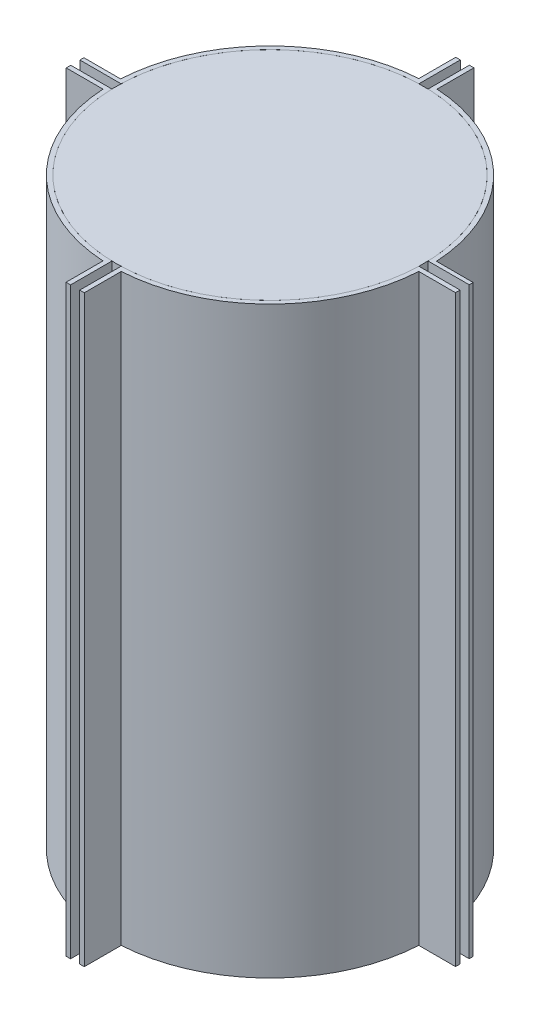
ISO-10303-21;
HEADER;
FILE_DESCRIPTION(('STEP AP214'),'2;1');
FILE_NAME('part.step','',(''),(''),'','','');
FILE_SCHEMA(('AUTOMOTIVE_DESIGN { 1 0 10303 214 1 1 1 1 }'));
ENDSEC;
DATA;
#1=APPLICATION_CONTEXT('core data for automotive mechanical design processes');
#2=APPLICATION_PROTOCOL_DEFINITION('international standard','automotive_design',2000,#1);
#3=PRODUCT_CONTEXT('',#1,'mechanical');
#4=PRODUCT('Part','Part','',(#3));
#5=PRODUCT_RELATED_PRODUCT_CATEGORY('part','',(#4));
#6=PRODUCT_DEFINITION_FORMATION('','',#4);
#7=PRODUCT_DEFINITION_CONTEXT('part definition',#1,'design');
#8=PRODUCT_DEFINITION('design','',#6,#7);
#9=PRODUCT_DEFINITION_SHAPE('','',#8);
#10=(LENGTH_UNIT() NAMED_UNIT(*) SI_UNIT(.MILLI.,.METRE.));
#11=(NAMED_UNIT(*) PLANE_ANGLE_UNIT() SI_UNIT($,.RADIAN.));
#12=(NAMED_UNIT(*) SI_UNIT($,.STERADIAN.) SOLID_ANGLE_UNIT());
#13=UNCERTAINTY_MEASURE_WITH_UNIT(LENGTH_MEASURE(1.E-05),#10,'distance_accuracy_value','');
#14=(GEOMETRIC_REPRESENTATION_CONTEXT(3) GLOBAL_UNCERTAINTY_ASSIGNED_CONTEXT((#13)) GLOBAL_UNIT_ASSIGNED_CONTEXT((#10,
#11,#12)) REPRESENTATION_CONTEXT('',''));
#15=CARTESIAN_POINT('',(0.,0.,0.));
#16=DIRECTION('',(0.,0.,1.));
#17=DIRECTION('',(1.,0.,0.));
#18=AXIS2_PLACEMENT_3D('',#15,#16,#17);
#19=CARTESIAN_POINT('',(0.,406.4,0.));
#20=DIRECTION('',(0.,-1.,0.));
#21=DIRECTION('',(0.,0.,-1.));
#22=AXIS2_PLACEMENT_3D('',#19,#20,#21);
#23=CYLINDRICAL_SURFACE('',#22,110.109);
#24=DIRECTION('',(0.,-1.,0.));
#25=VECTOR('',#24,1.);
#26=CARTESIAN_POINT('',(-6.34951847454214,406.4,-109.925772665656));
#27=LINE('',#26,#25);
#28=CARTESIAN_POINT('',(-6.34951847454214,0.,-109.925772665656));
#29=VERTEX_POINT('',#28);
#30=CARTESIAN_POINT('',(-6.34951847454214,406.4,-109.925772665656));
#31=VERTEX_POINT('',#30);
#32=EDGE_CURVE('E92',#29,#31,#27,.F.);
#33=ORIENTED_EDGE('',*,*,#32,.F.);
#34=CARTESIAN_POINT('',(0.,0.,0.));
#35=DIRECTION('',(0.,1.,0.));
#36=DIRECTION('',(0.,0.,1.));
#37=AXIS2_PLACEMENT_3D('',#34,#35,#36);
#38=CIRCLE('',#37,110.109);
#39=CARTESIAN_POINT('',(-109.948438829366,0.,-5.94412987619484));
#40=VERTEX_POINT('',#39);
#41=EDGE_CURVE('E198',#29,#40,#38,.T.);
#42=ORIENTED_EDGE('',*,*,#41,.T.);
#43=DIRECTION('',(0.,-1.,0.));
#44=VECTOR('',#43,1.);
#45=CARTESIAN_POINT('',(-109.948438829366,406.4,-5.94412987619484));
#46=LINE('',#45,#44);
#47=CARTESIAN_POINT('',(-109.948438829366,406.4,-5.94412987619484));
#48=VERTEX_POINT('',#47);
#49=EDGE_CURVE('E13',#48,#40,#46,.T.);
#50=ORIENTED_EDGE('',*,*,#49,.F.);
#51=CARTESIAN_POINT('',(0.,406.4,0.));
#52=DIRECTION('',(0.,1.,0.));
#53=DIRECTION('',(0.,0.,1.));
#54=AXIS2_PLACEMENT_3D('',#51,#52,#53);
#55=CIRCLE('',#54,110.109);
#56=EDGE_CURVE('E88',#31,#48,#55,.T.);
#57=ORIENTED_EDGE('',*,*,#56,.F.);
#58=EDGE_LOOP('',(#33,#42,#50,#57));
#59=FACE_BOUND('',#58,.T.);
#60=ADVANCED_FACE('F73',(#59),#23,.T.);
#61=CARTESIAN_POINT('',(0.,406.4,0.));
#62=DIRECTION('',(0.,1.,0.));
#63=DIRECTION('',(0.,0.,1.));
#64=AXIS2_PLACEMENT_3D('',#61,#62,#63);
#65=PLANE('',#64);
#66=DIRECTION('',(0.,0.,-1.));
#67=VECTOR('',#66,1.);
#68=CARTESIAN_POINT('',(-3.175,406.4,127.));
#69=LINE('',#68,#67);
#70=CARTESIAN_POINT('',(-3.175,406.4,-106.886854809186));
#71=VERTEX_POINT('',#70);
#72=CARTESIAN_POINT('',(-3.175,406.4,-135.646128135072));
#73=VERTEX_POINT('',#72);
#74=EDGE_CURVE('E135',#71,#73,#69,.T.);
#75=ORIENTED_EDGE('',*,*,#74,.T.);
#76=DIRECTION('',(-1.,0.,0.));
#77=VECTOR('',#76,1.);
#78=CARTESIAN_POINT('',(-3.175,406.4,-135.646128135072));
#79=LINE('',#78,#77);
#80=CARTESIAN_POINT('',(-6.34951847454214,406.4,-135.646128135072));
#81=VERTEX_POINT('',#80);
#82=EDGE_CURVE('E139',#73,#81,#79,.T.);
#83=ORIENTED_EDGE('',*,*,#82,.T.);
#84=DIRECTION('',(0.,0.,1.));
#85=VECTOR('',#84,1.);
#86=CARTESIAN_POINT('',(-6.34951847454214,406.4,-135.646128135072));
#87=LINE('',#86,#85);
#88=EDGE_CURVE('E160',#81,#31,#87,.T.);
#89=ORIENTED_EDGE('',*,*,#88,.T.);
#90=ORIENTED_EDGE('',*,*,#56,.T.);
#91=DIRECTION('',(-1.,0.,0.));
#92=VECTOR('',#91,1.);
#93=CARTESIAN_POINT('',(-135.520832555867,406.4,-5.94412987619484));
#94=LINE('',#93,#92);
#95=CARTESIAN_POINT('',(-135.520832555867,406.4,-5.94412987619484));
#96=VERTEX_POINT('',#95);
#97=EDGE_CURVE('E172',#48,#96,#94,.T.);
#98=ORIENTED_EDGE('',*,*,#97,.T.);
#99=DIRECTION('',(0.,0.,1.));
#100=VECTOR('',#99,1.);
#101=CARTESIAN_POINT('',(-135.520832555867,406.4,-3.175));
#102=LINE('',#101,#100);
#103=CARTESIAN_POINT('',(-135.520832555867,406.4,-3.175));
#104=VERTEX_POINT('',#103);
#105=EDGE_CURVE('E174',#96,#104,#102,.T.);
#106=ORIENTED_EDGE('',*,*,#105,.T.);
#107=DIRECTION('',(1.,0.,0.));
#108=VECTOR('',#107,1.);
#109=CARTESIAN_POINT('',(-127.,406.4,-3.175));
#110=LINE('',#109,#108);
#111=CARTESIAN_POINT('',(-106.886854809186,406.4,-3.175));
#112=VERTEX_POINT('',#111);
#113=EDGE_CURVE('E146',#104,#112,#110,.T.);
#114=ORIENTED_EDGE('',*,*,#113,.T.);
#115=CARTESIAN_POINT('',(0.,406.4,0.));
#116=DIRECTION('',(0.,1.,0.));
#117=DIRECTION('',(0.,0.,-1.));
#118=AXIS2_PLACEMENT_3D('',#115,#116,#117);
#119=CIRCLE('',#118,106.934);
#120=EDGE_CURVE('E143',#71,#112,#119,.T.);
#121=ORIENTED_EDGE('',*,*,#120,.F.);
#122=EDGE_LOOP('',(#75,#83,#89,#90,#98,#106,#114,#121));
#123=FACE_BOUND('',#122,.T.);
#124=ADVANCED_FACE('F75',(#123),#65,.T.);
#125=CARTESIAN_POINT('',(0.,0.,0.));
#126=DIRECTION('',(0.,1.,0.));
#127=DIRECTION('',(0.,0.,1.));
#128=AXIS2_PLACEMENT_3D('',#125,#126,#127);
#129=PLANE('',#128);
#130=ORIENTED_EDGE('',*,*,#41,.F.);
#131=DIRECTION('',(0.,0.,1.));
#132=VECTOR('',#131,1.);
#133=CARTESIAN_POINT('',(-6.34951847454214,0.,-135.646128135072));
#134=LINE('',#133,#132);
#135=CARTESIAN_POINT('',(-6.34951847454214,0.,-135.646128135072));
#136=VERTEX_POINT('',#135);
#137=EDGE_CURVE('E161',#136,#29,#134,.T.);
#138=ORIENTED_EDGE('',*,*,#137,.F.);
#139=DIRECTION('',(-1.,0.,0.));
#140=VECTOR('',#139,1.);
#141=CARTESIAN_POINT('',(-3.175,0.,-135.646128135072));
#142=LINE('',#141,#140);
#143=CARTESIAN_POINT('',(-3.175,0.,-135.646128135072));
#144=VERTEX_POINT('',#143);
#145=EDGE_CURVE('E165',#144,#136,#142,.T.);
#146=ORIENTED_EDGE('',*,*,#145,.F.);
#147=DIRECTION('',(0.,0.,-1.));
#148=VECTOR('',#147,1.);
#149=CARTESIAN_POINT('',(-3.175,0.,127.));
#150=LINE('',#149,#148);
#151=CARTESIAN_POINT('',(-3.175,0.,-106.886854809186));
#152=VERTEX_POINT('',#151);
#153=EDGE_CURVE('E152',#152,#144,#150,.T.);
#154=ORIENTED_EDGE('',*,*,#153,.F.);
#155=CARTESIAN_POINT('',(0.,0.,0.));
#156=DIRECTION('',(0.,1.,0.));
#157=DIRECTION('',(0.,0.,-1.));
#158=AXIS2_PLACEMENT_3D('',#155,#156,#157);
#159=CIRCLE('',#158,106.934);
#160=CARTESIAN_POINT('',(-106.886854809186,0.,-3.175));
#161=VERTEX_POINT('',#160);
#162=EDGE_CURVE('E195',#152,#161,#159,.T.);
#163=ORIENTED_EDGE('',*,*,#162,.T.);
#164=DIRECTION('',(1.,0.,0.));
#165=VECTOR('',#164,1.);
#166=CARTESIAN_POINT('',(-127.,0.,-3.175));
#167=LINE('',#166,#165);
#168=CARTESIAN_POINT('',(-135.520832555867,0.,-3.175));
#169=VERTEX_POINT('',#168);
#170=EDGE_CURVE('E188',#169,#161,#167,.T.);
#171=ORIENTED_EDGE('',*,*,#170,.F.);
#172=DIRECTION('',(0.,0.,1.));
#173=VECTOR('',#172,1.);
#174=CARTESIAN_POINT('',(-135.520832555867,0.,-3.175));
#175=LINE('',#174,#173);
#176=CARTESIAN_POINT('',(-135.520832555867,0.,-5.94412987619484));
#177=VERTEX_POINT('',#176);
#178=EDGE_CURVE('E175',#177,#169,#175,.T.);
#179=ORIENTED_EDGE('',*,*,#178,.F.);
#180=DIRECTION('',(-1.,0.,0.));
#181=VECTOR('',#180,1.);
#182=CARTESIAN_POINT('',(-135.520832555867,0.,-5.94412987619484));
#183=LINE('',#182,#181);
#184=EDGE_CURVE('E171',#40,#177,#183,.T.);
#185=ORIENTED_EDGE('',*,*,#184,.F.);
#186=EDGE_LOOP('',(#130,#138,#146,#154,#163,#171,#179,#185));
#187=FACE_BOUND('',#186,.T.);
#188=ADVANCED_FACE('F204',(#187),#129,.F.);
#189=CARTESIAN_POINT('',(0.,406.4,0.));
#190=DIRECTION('',(0.,-1.,0.));
#191=DIRECTION('',(0.,0.,-1.));
#192=AXIS2_PLACEMENT_3D('',#189,#190,#191);
#193=CYLINDRICAL_SURFACE('',#192,106.934);
#194=DIRECTION('',(0.,-1.,0.));
#195=VECTOR('',#194,1.);
#196=CARTESIAN_POINT('',(-106.886854809186,406.4,-3.175));
#197=LINE('',#196,#195);
#198=EDGE_CURVE('E81',#161,#112,#197,.F.);
#199=ORIENTED_EDGE('',*,*,#198,.F.);
#200=ORIENTED_EDGE('',*,*,#162,.F.);
#201=DIRECTION('',(0.,-1.,0.));
#202=VECTOR('',#201,1.);
#203=CARTESIAN_POINT('',(-3.175,406.4,-106.886854809186));
#204=LINE('',#203,#202);
#205=EDGE_CURVE('E189',#71,#152,#204,.T.);
#206=ORIENTED_EDGE('',*,*,#205,.F.);
#207=ORIENTED_EDGE('',*,*,#120,.T.);
#208=EDGE_LOOP('',(#199,#200,#206,#207));
#209=FACE_BOUND('',#208,.T.);
#210=ADVANCED_FACE('F201',(#209),#193,.F.);
#211=CARTESIAN_POINT('',(-3.175,406.4,127.));
#212=DIRECTION('',(-1.,0.,0.));
#213=DIRECTION('',(0.,0.,1.));
#214=AXIS2_PLACEMENT_3D('',#211,#212,#213);
#215=PLANE('',#214);
#216=ORIENTED_EDGE('',*,*,#74,.F.);
#217=ORIENTED_EDGE('',*,*,#205,.T.);
#218=ORIENTED_EDGE('',*,*,#153,.T.);
#219=DIRECTION('',(0.,-1.,0.));
#220=VECTOR('',#219,1.);
#221=CARTESIAN_POINT('',(-3.175,406.4,-135.646128135072));
#222=LINE('',#221,#220);
#223=EDGE_CURVE('E149',#73,#144,#222,.T.);
#224=ORIENTED_EDGE('',*,*,#223,.F.);
#225=EDGE_LOOP('',(#216,#217,#218,#224));
#226=FACE_BOUND('',#225,.T.);
#227=ADVANCED_FACE('F150',(#226),#215,.F.);
#228=CARTESIAN_POINT('',(-127.,406.4,-3.175));
#229=DIRECTION('',(0.,0.,-1.));
#230=DIRECTION('',(-1.,0.,0.));
#231=AXIS2_PLACEMENT_3D('',#228,#229,#230);
#232=PLANE('',#231);
#233=ORIENTED_EDGE('',*,*,#170,.T.);
#234=ORIENTED_EDGE('',*,*,#198,.T.);
#235=ORIENTED_EDGE('',*,*,#113,.F.);
#236=DIRECTION('',(0.,-1.,0.));
#237=VECTOR('',#236,1.);
#238=CARTESIAN_POINT('',(-135.520832555867,406.4,-3.175));
#239=LINE('',#238,#237);
#240=EDGE_CURVE('E178',#104,#169,#239,.T.);
#241=ORIENTED_EDGE('',*,*,#240,.T.);
#242=EDGE_LOOP('',(#233,#234,#235,#241));
#243=FACE_BOUND('',#242,.T.);
#244=ADVANCED_FACE('F219',(#243),#232,.F.);
#245=CARTESIAN_POINT('',(-135.520832555867,406.4,-5.94412987619484));
#246=DIRECTION('',(0.,0.,1.));
#247=DIRECTION('',(1.,0.,0.));
#248=AXIS2_PLACEMENT_3D('',#245,#246,#247);
#249=PLANE('',#248);
#250=ORIENTED_EDGE('',*,*,#97,.F.);
#251=ORIENTED_EDGE('',*,*,#49,.T.);
#252=ORIENTED_EDGE('',*,*,#184,.T.);
#253=DIRECTION('',(0.,-1.,0.));
#254=VECTOR('',#253,1.);
#255=CARTESIAN_POINT('',(-135.520832555867,406.4,-5.94412987619484));
#256=LINE('',#255,#254);
#257=EDGE_CURVE('E184',#96,#177,#256,.T.);
#258=ORIENTED_EDGE('',*,*,#257,.F.);
#259=EDGE_LOOP('',(#250,#251,#252,#258));
#260=FACE_BOUND('',#259,.T.);
#261=ADVANCED_FACE('F212',(#260),#249,.F.);
#262=CARTESIAN_POINT('',(-135.520832555867,406.4,-3.175));
#263=DIRECTION('',(1.,0.,0.));
#264=DIRECTION('',(0.,0.,-1.));
#265=AXIS2_PLACEMENT_3D('',#262,#263,#264);
#266=PLANE('',#265);
#267=ORIENTED_EDGE('',*,*,#178,.T.);
#268=ORIENTED_EDGE('',*,*,#240,.F.);
#269=ORIENTED_EDGE('',*,*,#105,.F.);
#270=ORIENTED_EDGE('',*,*,#257,.T.);
#271=EDGE_LOOP('',(#267,#268,#269,#270));
#272=FACE_BOUND('',#271,.T.);
#273=ADVANCED_FACE('F217',(#272),#266,.F.);
#274=CARTESIAN_POINT('',(-6.34951847454214,406.4,-135.646128135072));
#275=DIRECTION('',(1.,0.,0.));
#276=DIRECTION('',(0.,0.,-1.));
#277=AXIS2_PLACEMENT_3D('',#274,#275,#276);
#278=PLANE('',#277);
#279=ORIENTED_EDGE('',*,*,#137,.T.);
#280=ORIENTED_EDGE('',*,*,#32,.T.);
#281=ORIENTED_EDGE('',*,*,#88,.F.);
#282=DIRECTION('',(0.,-1.,0.));
#283=VECTOR('',#282,1.);
#284=CARTESIAN_POINT('',(-6.34951847454214,406.4,-135.646128135072));
#285=LINE('',#284,#283);
#286=EDGE_CURVE('E155',#81,#136,#285,.T.);
#287=ORIENTED_EDGE('',*,*,#286,.T.);
#288=EDGE_LOOP('',(#279,#280,#281,#287));
#289=FACE_BOUND('',#288,.T.);
#290=ADVANCED_FACE('F207',(#289),#278,.F.);
#291=CARTESIAN_POINT('',(-3.175,406.4,-135.646128135072));
#292=DIRECTION('',(0.,0.,1.));
#293=DIRECTION('',(1.,0.,0.));
#294=AXIS2_PLACEMENT_3D('',#291,#292,#293);
#295=PLANE('',#294);
#296=ORIENTED_EDGE('',*,*,#145,.T.);
#297=ORIENTED_EDGE('',*,*,#286,.F.);
#298=ORIENTED_EDGE('',*,*,#82,.F.);
#299=ORIENTED_EDGE('',*,*,#223,.T.);
#300=EDGE_LOOP('',(#296,#297,#298,#299));
#301=FACE_BOUND('',#300,.T.);
#302=ADVANCED_FACE('F157',(#301),#295,.F.);
#303=CLOSED_SHELL('',(#60,#124,#188,#210,#227,#244,#261,#273,#290,#302));
#304=MANIFOLD_SOLID_BREP('B2',#303);
#305=CARTESIAN_POINT('',(0.,406.4,0.));
#306=DIRECTION('',(0.,-1.,0.));
#307=DIRECTION('',(0.,0.,-1.));
#308=AXIS2_PLACEMENT_3D('',#305,#306,#307);
#309=CYLINDRICAL_SURFACE('',#308,110.109);
#310=DIRECTION('',(0.,-1.,0.));
#311=VECTOR('',#310,1.);
#312=CARTESIAN_POINT('',(6.34951847454214,406.4,109.925772665656));
#313=LINE('',#312,#311);
#314=CARTESIAN_POINT('',(6.34951847454214,0.,109.925772665656));
#315=VERTEX_POINT('',#314);
#316=CARTESIAN_POINT('',(6.34951847454214,406.4,109.925772665656));
#317=VERTEX_POINT('',#316);
#318=EDGE_CURVE('E431',#315,#317,#313,.F.);
#319=ORIENTED_EDGE('',*,*,#318,.F.);
#320=CARTESIAN_POINT('',(0.,0.,0.));
#321=DIRECTION('',(0.,1.,0.));
#322=DIRECTION('',(0.,0.,1.));
#323=AXIS2_PLACEMENT_3D('',#320,#321,#322);
#324=CIRCLE('',#323,110.109);
#325=CARTESIAN_POINT('',(109.925744850786,0.,6.35));
#326=VERTEX_POINT('',#325);
#327=EDGE_CURVE('E458',#315,#326,#324,.T.);
#328=ORIENTED_EDGE('',*,*,#327,.T.);
#329=DIRECTION('',(0.,-1.,0.));
#330=VECTOR('',#329,1.);
#331=CARTESIAN_POINT('',(109.925744850786,406.4,6.35));
#332=LINE('',#331,#330);
#333=CARTESIAN_POINT('',(109.925744850786,406.4,6.35));
#334=VERTEX_POINT('',#333);
#335=EDGE_CURVE('E453',#334,#326,#332,.T.);
#336=ORIENTED_EDGE('',*,*,#335,.F.);
#337=CARTESIAN_POINT('',(0.,406.4,0.));
#338=DIRECTION('',(0.,1.,0.));
#339=DIRECTION('',(0.,0.,1.));
#340=AXIS2_PLACEMENT_3D('',#337,#338,#339);
#341=CIRCLE('',#340,110.109);
#342=EDGE_CURVE('E415',#317,#334,#341,.T.);
#343=ORIENTED_EDGE('',*,*,#342,.F.);
#344=EDGE_LOOP('',(#319,#328,#336,#343));
#345=FACE_BOUND('',#344,.T.);
#346=ADVANCED_FACE('F346',(#345),#309,.T.);
#347=CARTESIAN_POINT('',(0.,406.4,0.));
#348=DIRECTION('',(0.,-1.,0.));
#349=DIRECTION('',(0.,0.,-1.));
#350=AXIS2_PLACEMENT_3D('',#347,#348,#349);
#351=CYLINDRICAL_SURFACE('',#350,106.934);
#352=CARTESIAN_POINT('',(0.,406.4,0.));
#353=DIRECTION('',(0.,1.,0.));
#354=DIRECTION('',(0.,0.,-1.));
#355=AXIS2_PLACEMENT_3D('',#352,#353,#354);
#356=CIRCLE('',#355,106.934);
#357=CARTESIAN_POINT('',(3.175,406.4,106.886854809186));
#358=VERTEX_POINT('',#357);
#359=CARTESIAN_POINT('',(106.886854809186,406.4,3.17499999999997));
#360=VERTEX_POINT('',#359);
#361=EDGE_CURVE('E350',#358,#360,#356,.T.);
#362=ORIENTED_EDGE('',*,*,#361,.T.);
#363=DIRECTION('',(0.,-1.,0.));
#364=VECTOR('',#363,1.);
#365=CARTESIAN_POINT('',(106.886854809186,406.4,3.17499999999997));
#366=LINE('',#365,#364);
#367=CARTESIAN_POINT('',(106.886854809186,0.,3.17499999999997));
#368=VERTEX_POINT('',#367);
#369=EDGE_CURVE('E363',#360,#368,#366,.T.);
#370=ORIENTED_EDGE('',*,*,#369,.T.);
#371=CARTESIAN_POINT('',(0.,0.,0.));
#372=DIRECTION('',(0.,1.,0.));
#373=DIRECTION('',(0.,0.,-1.));
#374=AXIS2_PLACEMENT_3D('',#371,#372,#373);
#375=CIRCLE('',#374,106.934);
#376=CARTESIAN_POINT('',(3.175,0.,106.886854809186));
#377=VERTEX_POINT('',#376);
#378=EDGE_CURVE('E460',#377,#368,#375,.T.);
#379=ORIENTED_EDGE('',*,*,#378,.F.);
#380=DIRECTION('',(0.,-1.,0.));
#381=VECTOR('',#380,1.);
#382=CARTESIAN_POINT('',(3.175,406.4,106.886854809186));
#383=LINE('',#382,#381);
#384=EDGE_CURVE('E457',#377,#358,#383,.F.);
#385=ORIENTED_EDGE('',*,*,#384,.T.);
#386=EDGE_LOOP('',(#362,#370,#379,#385));
#387=FACE_BOUND('',#386,.T.);
#388=ADVANCED_FACE('F472',(#387),#351,.F.);
#389=CARTESIAN_POINT('',(0.,0.,0.));
#390=DIRECTION('',(0.,1.,0.));
#391=DIRECTION('',(0.,0.,1.));
#392=AXIS2_PLACEMENT_3D('',#389,#390,#391);
#393=PLANE('',#392);
#394=ORIENTED_EDGE('',*,*,#327,.F.);
#395=DIRECTION('',(0.,0.,-1.));
#396=VECTOR('',#395,1.);
#397=CARTESIAN_POINT('',(6.34951847454214,0.,135.646128135072));
#398=LINE('',#397,#396);
#399=CARTESIAN_POINT('',(6.34951847454214,0.,135.646128135072));
#400=VERTEX_POINT('',#399);
#401=EDGE_CURVE('E425',#400,#315,#398,.T.);
#402=ORIENTED_EDGE('',*,*,#401,.F.);
#403=DIRECTION('',(1.,0.,0.));
#404=VECTOR('',#403,1.);
#405=CARTESIAN_POINT('',(3.175,0.,135.646128135072));
#406=LINE('',#405,#404);
#407=CARTESIAN_POINT('',(3.175,0.,135.646128135072));
#408=VERTEX_POINT('',#407);
#409=EDGE_CURVE('E504',#408,#400,#406,.T.);
#410=ORIENTED_EDGE('',*,*,#409,.F.);
#411=DIRECTION('',(0.,0.,-1.));
#412=VECTOR('',#411,1.);
#413=CARTESIAN_POINT('',(3.175,0.,127.));
#414=LINE('',#413,#412);
#415=EDGE_CURVE('E429',#408,#377,#414,.T.);
#416=ORIENTED_EDGE('',*,*,#415,.T.);
#417=ORIENTED_EDGE('',*,*,#378,.T.);
#418=DIRECTION('',(1.,0.,0.));
#419=VECTOR('',#418,1.);
#420=CARTESIAN_POINT('',(-127.,0.,3.175));
#421=LINE('',#420,#419);
#422=CARTESIAN_POINT('',(135.520832641872,0.,3.17499999999997));
#423=VERTEX_POINT('',#422);
#424=EDGE_CURVE('E461',#368,#423,#421,.T.);
#425=ORIENTED_EDGE('',*,*,#424,.T.);
#426=DIRECTION('',(0.,0.,-1.));
#427=VECTOR('',#426,1.);
#428=CARTESIAN_POINT('',(135.520832641872,0.,3.17499999999997));
#429=LINE('',#428,#427);
#430=CARTESIAN_POINT('',(135.520832641872,0.,6.34999999999997));
#431=VERTEX_POINT('',#430);
#432=EDGE_CURVE('E433',#431,#423,#429,.T.);
#433=ORIENTED_EDGE('',*,*,#432,.F.);
#434=DIRECTION('',(1.,0.,0.));
#435=VECTOR('',#434,1.);
#436=CARTESIAN_POINT('',(135.520832641872,0.,6.34999999999997));
#437=LINE('',#436,#435);
#438=EDGE_CURVE('E442',#326,#431,#437,.T.);
#439=ORIENTED_EDGE('',*,*,#438,.F.);
#440=EDGE_LOOP('',(#394,#402,#410,#416,#417,#425,#433,#439));
#441=FACE_BOUND('',#440,.T.);
#442=ADVANCED_FACE('F469',(#441),#393,.F.);
#443=CARTESIAN_POINT('',(0.,406.4,0.));
#444=DIRECTION('',(0.,1.,0.));
#445=DIRECTION('',(0.,0.,1.));
#446=AXIS2_PLACEMENT_3D('',#443,#444,#445);
#447=PLANE('',#446);
#448=DIRECTION('',(0.,0.,-1.));
#449=VECTOR('',#448,1.);
#450=CARTESIAN_POINT('',(3.175,406.4,127.));
#451=LINE('',#450,#449);
#452=CARTESIAN_POINT('',(3.175,406.4,135.646128135072));
#453=VERTEX_POINT('',#452);
#454=EDGE_CURVE('E356',#453,#358,#451,.T.);
#455=ORIENTED_EDGE('',*,*,#454,.F.);
#456=DIRECTION('',(1.,0.,0.));
#457=VECTOR('',#456,1.);
#458=CARTESIAN_POINT('',(3.175,406.4,135.646128135072));
#459=LINE('',#458,#457);
#460=CARTESIAN_POINT('',(6.34951847454214,406.4,135.646128135072));
#461=VERTEX_POINT('',#460);
#462=EDGE_CURVE('E408',#453,#461,#459,.T.);
#463=ORIENTED_EDGE('',*,*,#462,.T.);
#464=DIRECTION('',(0.,0.,-1.));
#465=VECTOR('',#464,1.);
#466=CARTESIAN_POINT('',(6.34951847454214,406.4,135.646128135072));
#467=LINE('',#466,#465);
#468=EDGE_CURVE('E424',#461,#317,#467,.T.);
#469=ORIENTED_EDGE('',*,*,#468,.T.);
#470=ORIENTED_EDGE('',*,*,#342,.T.);
#471=DIRECTION('',(1.,0.,0.));
#472=VECTOR('',#471,1.);
#473=CARTESIAN_POINT('',(135.520832641872,406.4,6.34999999999997));
#474=LINE('',#473,#472);
#475=CARTESIAN_POINT('',(135.520832641872,406.4,6.34999999999997));
#476=VERTEX_POINT('',#475);
#477=EDGE_CURVE('E441',#334,#476,#474,.T.);
#478=ORIENTED_EDGE('',*,*,#477,.T.);
#479=DIRECTION('',(0.,0.,-1.));
#480=VECTOR('',#479,1.);
#481=CARTESIAN_POINT('',(135.520832641872,406.4,3.17499999999997));
#482=LINE('',#481,#480);
#483=CARTESIAN_POINT('',(135.520832641872,406.4,3.17499999999997));
#484=VERTEX_POINT('',#483);
#485=EDGE_CURVE('E438',#476,#484,#482,.T.);
#486=ORIENTED_EDGE('',*,*,#485,.T.);
#487=DIRECTION('',(1.,0.,0.));
#488=VECTOR('',#487,1.);
#489=CARTESIAN_POINT('',(-127.,406.4,3.175));
#490=LINE('',#489,#488);
#491=EDGE_CURVE('E71',#360,#484,#490,.T.);
#492=ORIENTED_EDGE('',*,*,#491,.F.);
#493=ORIENTED_EDGE('',*,*,#361,.F.);
#494=EDGE_LOOP('',(#455,#463,#469,#470,#478,#486,#492,#493));
#495=FACE_BOUND('',#494,.T.);
#496=ADVANCED_FACE('F348',(#495),#447,.T.);
#497=CARTESIAN_POINT('',(3.175,406.4,127.));
#498=DIRECTION('',(-1.,0.,0.));
#499=DIRECTION('',(0.,0.,1.));
#500=AXIS2_PLACEMENT_3D('',#497,#498,#499);
#501=PLANE('',#500);
#502=ORIENTED_EDGE('',*,*,#415,.F.);
#503=DIRECTION('',(0.,-1.,0.));
#504=VECTOR('',#503,1.);
#505=CARTESIAN_POINT('',(3.175,406.4,135.646128135072));
#506=LINE('',#505,#504);
#507=EDGE_CURVE('E420',#453,#408,#506,.T.);
#508=ORIENTED_EDGE('',*,*,#507,.F.);
#509=ORIENTED_EDGE('',*,*,#454,.T.);
#510=ORIENTED_EDGE('',*,*,#384,.F.);
#511=EDGE_LOOP('',(#502,#508,#509,#510));
#512=FACE_BOUND('',#511,.T.);
#513=ADVANCED_FACE('F427',(#512),#501,.T.);
#514=CARTESIAN_POINT('',(-127.,406.4,3.175));
#515=DIRECTION('',(0.,0.,-1.));
#516=DIRECTION('',(-1.,0.,0.));
#517=AXIS2_PLACEMENT_3D('',#514,#515,#516);
#518=PLANE('',#517);
#519=ORIENTED_EDGE('',*,*,#491,.T.);
#520=DIRECTION('',(0.,-1.,0.));
#521=VECTOR('',#520,1.);
#522=CARTESIAN_POINT('',(135.520832641872,406.4,3.17499999999997));
#523=LINE('',#522,#521);
#524=EDGE_CURVE('E450',#484,#423,#523,.T.);
#525=ORIENTED_EDGE('',*,*,#524,.T.);
#526=ORIENTED_EDGE('',*,*,#424,.F.);
#527=ORIENTED_EDGE('',*,*,#369,.F.);
#528=EDGE_LOOP('',(#519,#525,#526,#527));
#529=FACE_BOUND('',#528,.T.);
#530=ADVANCED_FACE('F482',(#529),#518,.T.);
#531=CARTESIAN_POINT('',(135.520832641872,406.4,6.34999999999997));
#532=DIRECTION('',(0.,0.,-1.));
#533=DIRECTION('',(-1.,0.,0.));
#534=AXIS2_PLACEMENT_3D('',#531,#532,#533);
#535=PLANE('',#534);
#536=ORIENTED_EDGE('',*,*,#477,.F.);
#537=ORIENTED_EDGE('',*,*,#335,.T.);
#538=ORIENTED_EDGE('',*,*,#438,.T.);
#539=DIRECTION('',(0.,-1.,0.));
#540=VECTOR('',#539,1.);
#541=CARTESIAN_POINT('',(135.520832641872,406.4,6.34999999999997));
#542=LINE('',#541,#540);
#543=EDGE_CURVE('E444',#476,#431,#542,.T.);
#544=ORIENTED_EDGE('',*,*,#543,.F.);
#545=EDGE_LOOP('',(#536,#537,#538,#544));
#546=FACE_BOUND('',#545,.T.);
#547=ADVANCED_FACE('F485',(#546),#535,.F.);
#548=CARTESIAN_POINT('',(135.520832641872,406.4,3.17499999999997));
#549=DIRECTION('',(-1.,0.,0.));
#550=DIRECTION('',(0.,0.,1.));
#551=AXIS2_PLACEMENT_3D('',#548,#549,#550);
#552=PLANE('',#551);
#553=ORIENTED_EDGE('',*,*,#432,.T.);
#554=ORIENTED_EDGE('',*,*,#524,.F.);
#555=ORIENTED_EDGE('',*,*,#485,.F.);
#556=ORIENTED_EDGE('',*,*,#543,.T.);
#557=EDGE_LOOP('',(#553,#554,#555,#556));
#558=FACE_BOUND('',#557,.T.);
#559=ADVANCED_FACE('F488',(#558),#552,.F.);
#560=CARTESIAN_POINT('',(6.34951847454214,406.4,135.646128135072));
#561=DIRECTION('',(-1.,0.,0.));
#562=DIRECTION('',(0.,0.,1.));
#563=AXIS2_PLACEMENT_3D('',#560,#561,#562);
#564=PLANE('',#563);
#565=ORIENTED_EDGE('',*,*,#401,.T.);
#566=ORIENTED_EDGE('',*,*,#318,.T.);
#567=ORIENTED_EDGE('',*,*,#468,.F.);
#568=DIRECTION('',(0.,-1.,0.));
#569=VECTOR('',#568,1.);
#570=CARTESIAN_POINT('',(6.34951847454214,406.4,135.646128135072));
#571=LINE('',#570,#569);
#572=EDGE_CURVE('E422',#461,#400,#571,.T.);
#573=ORIENTED_EDGE('',*,*,#572,.T.);
#574=EDGE_LOOP('',(#565,#566,#567,#573));
#575=FACE_BOUND('',#574,.T.);
#576=ADVANCED_FACE('F491',(#575),#564,.F.);
#577=CARTESIAN_POINT('',(3.175,406.4,135.646128135072));
#578=DIRECTION('',(0.,0.,-1.));
#579=DIRECTION('',(-1.,0.,0.));
#580=AXIS2_PLACEMENT_3D('',#577,#578,#579);
#581=PLANE('',#580);
#582=ORIENTED_EDGE('',*,*,#409,.T.);
#583=ORIENTED_EDGE('',*,*,#572,.F.);
#584=ORIENTED_EDGE('',*,*,#462,.F.);
#585=ORIENTED_EDGE('',*,*,#507,.T.);
#586=EDGE_LOOP('',(#582,#583,#584,#585));
#587=FACE_BOUND('',#586,.T.);
#588=ADVANCED_FACE('F419',(#587),#581,.F.);
#589=CLOSED_SHELL('',(#346,#388,#442,#496,#513,#530,#547,#559,#576,#588));
#590=MANIFOLD_SOLID_BREP('B7',#589);
#591=CARTESIAN_POINT('',(0.,406.4,0.));
#592=DIRECTION('',(0.,-1.,0.));
#593=DIRECTION('',(0.,0.,-1.));
#594=AXIS2_PLACEMENT_3D('',#591,#592,#593);
#595=CYLINDRICAL_SURFACE('',#594,110.109);
#596=DIRECTION('',(0.,-1.,0.));
#597=VECTOR('',#596,1.);
#598=CARTESIAN_POINT('',(-6.34951847454214,406.4,109.925772665656));
#599=LINE('',#598,#597);
#600=CARTESIAN_POINT('',(-6.34951847454214,406.4,109.925772665656));
#601=VERTEX_POINT('',#600);
#602=CARTESIAN_POINT('',(-6.34951847454214,0.,109.925772665656));
#603=VERTEX_POINT('',#602);
#604=EDGE_CURVE('E639',#601,#603,#599,.T.);
#605=ORIENTED_EDGE('',*,*,#604,.F.);
#606=CARTESIAN_POINT('',(0.,406.4,0.));
#607=DIRECTION('',(0.,1.,0.));
#608=DIRECTION('',(0.,0.,1.));
#609=AXIS2_PLACEMENT_3D('',#606,#607,#608);
#610=CIRCLE('',#609,110.109);
#611=CARTESIAN_POINT('',(-109.925744850786,406.4,6.35));
#612=VERTEX_POINT('',#611);
#613=EDGE_CURVE('E695',#612,#601,#610,.T.);
#614=ORIENTED_EDGE('',*,*,#613,.F.);
#615=DIRECTION('',(0.,-1.,0.));
#616=VECTOR('',#615,1.);
#617=CARTESIAN_POINT('',(-109.925744850786,406.4,6.35));
#618=LINE('',#617,#616);
#619=CARTESIAN_POINT('',(-109.925744850786,0.,6.35));
#620=VERTEX_POINT('',#619);
#621=EDGE_CURVE('E731',#620,#612,#618,.F.);
#622=ORIENTED_EDGE('',*,*,#621,.F.);
#623=CARTESIAN_POINT('',(0.,0.,0.));
#624=DIRECTION('',(0.,1.,0.));
#625=DIRECTION('',(0.,0.,1.));
#626=AXIS2_PLACEMENT_3D('',#623,#624,#625);
#627=CIRCLE('',#626,110.109);
#628=EDGE_CURVE('E623',#620,#603,#627,.T.);
#629=ORIENTED_EDGE('',*,*,#628,.T.);
#630=EDGE_LOOP('',(#605,#614,#622,#629));
#631=FACE_BOUND('',#630,.T.);
#632=ADVANCED_FACE('F619',(#631),#595,.T.);
#633=CARTESIAN_POINT('',(0.,406.4,0.));
#634=DIRECTION('',(0.,-1.,0.));
#635=DIRECTION('',(0.,0.,-1.));
#636=AXIS2_PLACEMENT_3D('',#633,#634,#635);
#637=CYLINDRICAL_SURFACE('',#636,106.934);
#638=CARTESIAN_POINT('',(0.,0.,0.));
#639=DIRECTION('',(0.,1.,0.));
#640=DIRECTION('',(0.,0.,-1.));
#641=AXIS2_PLACEMENT_3D('',#638,#639,#640);
#642=CIRCLE('',#641,106.934);
#643=CARTESIAN_POINT('',(-106.886854809186,0.,3.175));
#644=VERTEX_POINT('',#643);
#645=CARTESIAN_POINT('',(-3.175,0.,106.886854809186));
#646=VERTEX_POINT('',#645);
#647=EDGE_CURVE('E740',#644,#646,#642,.T.);
#648=ORIENTED_EDGE('',*,*,#647,.F.);
#649=DIRECTION('',(0.,-1.,0.));
#650=VECTOR('',#649,1.);
#651=CARTESIAN_POINT('',(-106.886854809186,406.4,3.175));
#652=LINE('',#651,#650);
#653=CARTESIAN_POINT('',(-106.886854809186,406.4,3.175));
#654=VERTEX_POINT('',#653);
#655=EDGE_CURVE('E733',#644,#654,#652,.F.);
#656=ORIENTED_EDGE('',*,*,#655,.T.);
#657=CARTESIAN_POINT('',(0.,406.4,0.));
#658=DIRECTION('',(0.,1.,0.));
#659=DIRECTION('',(0.,0.,-1.));
#660=AXIS2_PLACEMENT_3D('',#657,#658,#659);
#661=CIRCLE('',#660,106.934);
#662=CARTESIAN_POINT('',(-3.175,406.4,106.886854809186));
#663=VERTEX_POINT('',#662);
#664=EDGE_CURVE('E736',#654,#663,#661,.T.);
#665=ORIENTED_EDGE('',*,*,#664,.T.);
#666=DIRECTION('',(0.,-1.,0.));
#667=VECTOR('',#666,1.);
#668=CARTESIAN_POINT('',(-3.175,406.4,106.886854809186));
#669=LINE('',#668,#667);
#670=EDGE_CURVE('E628',#646,#663,#669,.F.);
#671=ORIENTED_EDGE('',*,*,#670,.F.);
#672=EDGE_LOOP('',(#648,#656,#665,#671));
#673=FACE_BOUND('',#672,.T.);
#674=ADVANCED_FACE('F747',(#673),#637,.F.);
#675=CARTESIAN_POINT('',(0.,0.,0.));
#676=DIRECTION('',(0.,1.,0.));
#677=DIRECTION('',(0.,0.,1.));
#678=AXIS2_PLACEMENT_3D('',#675,#676,#677);
#679=PLANE('',#678);
#680=DIRECTION('',(0.,0.,-1.));
#681=VECTOR('',#680,1.);
#682=CARTESIAN_POINT('',(-3.175,0.,127.));
#683=LINE('',#682,#681);
#684=CARTESIAN_POINT('',(-3.175,0.,135.646128135072));
#685=VERTEX_POINT('',#684);
#686=EDGE_CURVE('E694',#685,#646,#683,.T.);
#687=ORIENTED_EDGE('',*,*,#686,.F.);
#688=DIRECTION('',(1.,0.,0.));
#689=VECTOR('',#688,1.);
#690=CARTESIAN_POINT('',(-3.175,0.,135.646128135072));
#691=LINE('',#690,#689);
#692=CARTESIAN_POINT('',(-6.34951847454214,0.,135.646128135072));
#693=VERTEX_POINT('',#692);
#694=EDGE_CURVE('E709',#693,#685,#691,.T.);
#695=ORIENTED_EDGE('',*,*,#694,.F.);
#696=DIRECTION('',(0.,0.,1.));
#697=VECTOR('',#696,1.);
#698=CARTESIAN_POINT('',(-6.34951847454214,0.,135.646128135072));
#699=LINE('',#698,#697);
#700=EDGE_CURVE('E705',#603,#693,#699,.T.);
#701=ORIENTED_EDGE('',*,*,#700,.F.);
#702=ORIENTED_EDGE('',*,*,#628,.F.);
#703=DIRECTION('',(1.,0.,0.));
#704=VECTOR('',#703,1.);
#705=CARTESIAN_POINT('',(-135.520832641872,0.,6.35));
#706=LINE('',#705,#704);
#707=CARTESIAN_POINT('',(-135.520832641872,0.,6.35));
#708=VERTEX_POINT('',#707);
#709=EDGE_CURVE('E720',#708,#620,#706,.T.);
#710=ORIENTED_EDGE('',*,*,#709,.F.);
#711=DIRECTION('',(0.,0.,1.));
#712=VECTOR('',#711,1.);
#713=CARTESIAN_POINT('',(-135.520832641872,0.,3.175));
#714=LINE('',#713,#712);
#715=CARTESIAN_POINT('',(-135.520832641872,0.,3.175));
#716=VERTEX_POINT('',#715);
#717=EDGE_CURVE('E712',#716,#708,#714,.T.);
#718=ORIENTED_EDGE('',*,*,#717,.F.);
#719=DIRECTION('',(1.,0.,0.));
#720=VECTOR('',#719,1.);
#721=CARTESIAN_POINT('',(-127.,0.,3.175));
#722=LINE('',#721,#720);
#723=EDGE_CURVE('E738',#716,#644,#722,.T.);
#724=ORIENTED_EDGE('',*,*,#723,.T.);
#725=ORIENTED_EDGE('',*,*,#647,.T.);
#726=EDGE_LOOP('',(#687,#695,#701,#702,#710,#718,#724,#725));
#727=FACE_BOUND('',#726,.T.);
#728=ADVANCED_FACE('F761',(#727),#679,.F.);
#729=CARTESIAN_POINT('',(0.,406.4,0.));
#730=DIRECTION('',(0.,1.,0.));
#731=DIRECTION('',(0.,0.,1.));
#732=AXIS2_PLACEMENT_3D('',#729,#730,#731);
#733=PLANE('',#732);
#734=ORIENTED_EDGE('',*,*,#613,.T.);
#735=DIRECTION('',(0.,0.,1.));
#736=VECTOR('',#735,1.);
#737=CARTESIAN_POINT('',(-6.34951847454214,406.4,135.646128135072));
#738=LINE('',#737,#736);
#739=CARTESIAN_POINT('',(-6.34951847454214,406.4,135.646128135072));
#740=VERTEX_POINT('',#739);
#741=EDGE_CURVE('E701',#601,#740,#738,.T.);
#742=ORIENTED_EDGE('',*,*,#741,.T.);
#743=DIRECTION('',(1.,0.,0.));
#744=VECTOR('',#743,1.);
#745=CARTESIAN_POINT('',(-3.175,406.4,135.646128135072));
#746=LINE('',#745,#744);
#747=CARTESIAN_POINT('',(-3.175,406.4,135.646128135072));
#748=VERTEX_POINT('',#747);
#749=EDGE_CURVE('E698',#740,#748,#746,.T.);
#750=ORIENTED_EDGE('',*,*,#749,.T.);
#751=DIRECTION('',(0.,0.,-1.));
#752=VECTOR('',#751,1.);
#753=CARTESIAN_POINT('',(-3.175,406.4,127.));
#754=LINE('',#753,#752);
#755=EDGE_CURVE('E684',#748,#663,#754,.T.);
#756=ORIENTED_EDGE('',*,*,#755,.T.);
#757=ORIENTED_EDGE('',*,*,#664,.F.);
#758=DIRECTION('',(1.,0.,0.));
#759=VECTOR('',#758,1.);
#760=CARTESIAN_POINT('',(-127.,406.4,3.175));
#761=LINE('',#760,#759);
#762=CARTESIAN_POINT('',(-135.520832641872,406.4,3.175));
#763=VERTEX_POINT('',#762);
#764=EDGE_CURVE('E344',#763,#654,#761,.T.);
#765=ORIENTED_EDGE('',*,*,#764,.F.);
#766=DIRECTION('',(0.,0.,1.));
#767=VECTOR('',#766,1.);
#768=CARTESIAN_POINT('',(-135.520832641872,406.4,3.175));
#769=LINE('',#768,#767);
#770=CARTESIAN_POINT('',(-135.520832641872,406.4,6.35));
#771=VERTEX_POINT('',#770);
#772=EDGE_CURVE('E717',#763,#771,#769,.T.);
#773=ORIENTED_EDGE('',*,*,#772,.T.);
#774=DIRECTION('',(1.,0.,0.));
#775=VECTOR('',#774,1.);
#776=CARTESIAN_POINT('',(-135.520832641872,406.4,6.35));
#777=LINE('',#776,#775);
#778=EDGE_CURVE('E719',#771,#612,#777,.T.);
#779=ORIENTED_EDGE('',*,*,#778,.T.);
#780=EDGE_LOOP('',(#734,#742,#750,#756,#757,#765,#773,#779));
#781=FACE_BOUND('',#780,.T.);
#782=ADVANCED_FACE('F699',(#781),#733,.T.);
#783=CARTESIAN_POINT('',(-3.175,406.4,127.));
#784=DIRECTION('',(-1.,0.,0.));
#785=DIRECTION('',(0.,0.,1.));
#786=AXIS2_PLACEMENT_3D('',#783,#784,#785);
#787=PLANE('',#786);
#788=ORIENTED_EDGE('',*,*,#686,.T.);
#789=ORIENTED_EDGE('',*,*,#670,.T.);
#790=ORIENTED_EDGE('',*,*,#755,.F.);
#791=DIRECTION('',(0.,-1.,0.));
#792=VECTOR('',#791,1.);
#793=CARTESIAN_POINT('',(-3.175,406.4,135.646128135072));
#794=LINE('',#793,#792);
#795=EDGE_CURVE('E688',#748,#685,#794,.T.);
#796=ORIENTED_EDGE('',*,*,#795,.T.);
#797=EDGE_LOOP('',(#788,#789,#790,#796));
#798=FACE_BOUND('',#797,.T.);
#799=ADVANCED_FACE('F686',(#798),#787,.F.);
#800=CARTESIAN_POINT('',(-127.,406.4,3.175));
#801=DIRECTION('',(0.,0.,-1.));
#802=DIRECTION('',(-1.,0.,0.));
#803=AXIS2_PLACEMENT_3D('',#800,#801,#802);
#804=PLANE('',#803);
#805=ORIENTED_EDGE('',*,*,#723,.F.);
#806=DIRECTION('',(0.,-1.,0.));
#807=VECTOR('',#806,1.);
#808=CARTESIAN_POINT('',(-135.520832641872,406.4,3.175));
#809=LINE('',#808,#807);
#810=EDGE_CURVE('E728',#763,#716,#809,.T.);
#811=ORIENTED_EDGE('',*,*,#810,.F.);
#812=ORIENTED_EDGE('',*,*,#764,.T.);
#813=ORIENTED_EDGE('',*,*,#655,.F.);
#814=EDGE_LOOP('',(#805,#811,#812,#813));
#815=FACE_BOUND('',#814,.T.);
#816=ADVANCED_FACE('F621',(#815),#804,.T.);
#817=CARTESIAN_POINT('',(-135.520832641872,406.4,6.35));
#818=DIRECTION('',(0.,0.,-1.));
#819=DIRECTION('',(-1.,0.,0.));
#820=AXIS2_PLACEMENT_3D('',#817,#818,#819);
#821=PLANE('',#820);
#822=ORIENTED_EDGE('',*,*,#709,.T.);
#823=ORIENTED_EDGE('',*,*,#621,.T.);
#824=ORIENTED_EDGE('',*,*,#778,.F.);
#825=DIRECTION('',(0.,-1.,0.));
#826=VECTOR('',#825,1.);
#827=CARTESIAN_POINT('',(-135.520832641872,406.4,6.35));
#828=LINE('',#827,#826);
#829=EDGE_CURVE('E723',#771,#708,#828,.T.);
#830=ORIENTED_EDGE('',*,*,#829,.T.);
#831=EDGE_LOOP('',(#822,#823,#824,#830));
#832=FACE_BOUND('',#831,.T.);
#833=ADVANCED_FACE('F758',(#832),#821,.F.);
#834=CARTESIAN_POINT('',(-135.520832641872,406.4,3.175));
#835=DIRECTION('',(1.,0.,0.));
#836=DIRECTION('',(0.,0.,-1.));
#837=AXIS2_PLACEMENT_3D('',#834,#835,#836);
#838=PLANE('',#837);
#839=ORIENTED_EDGE('',*,*,#717,.T.);
#840=ORIENTED_EDGE('',*,*,#829,.F.);
#841=ORIENTED_EDGE('',*,*,#772,.F.);
#842=ORIENTED_EDGE('',*,*,#810,.T.);
#843=EDGE_LOOP('',(#839,#840,#841,#842));
#844=FACE_BOUND('',#843,.T.);
#845=ADVANCED_FACE('F754',(#844),#838,.F.);
#846=CARTESIAN_POINT('',(-6.34951847454214,406.4,135.646128135072));
#847=DIRECTION('',(1.,0.,0.));
#848=DIRECTION('',(0.,0.,-1.));
#849=AXIS2_PLACEMENT_3D('',#846,#847,#848);
#850=PLANE('',#849);
#851=ORIENTED_EDGE('',*,*,#741,.F.);
#852=ORIENTED_EDGE('',*,*,#604,.T.);
#853=ORIENTED_EDGE('',*,*,#700,.T.);
#854=DIRECTION('',(0.,-1.,0.));
#855=VECTOR('',#854,1.);
#856=CARTESIAN_POINT('',(-6.34951847454214,406.4,135.646128135072));
#857=LINE('',#856,#855);
#858=EDGE_CURVE('E710',#740,#693,#857,.T.);
#859=ORIENTED_EDGE('',*,*,#858,.F.);
#860=EDGE_LOOP('',(#851,#852,#853,#859));
#861=FACE_BOUND('',#860,.T.);
#862=ADVANCED_FACE('F765',(#861),#850,.F.);
#863=CARTESIAN_POINT('',(-3.175,406.4,135.646128135072));
#864=DIRECTION('',(0.,0.,-1.));
#865=DIRECTION('',(-1.,0.,0.));
#866=AXIS2_PLACEMENT_3D('',#863,#864,#865);
#867=PLANE('',#866);
#868=ORIENTED_EDGE('',*,*,#694,.T.);
#869=ORIENTED_EDGE('',*,*,#795,.F.);
#870=ORIENTED_EDGE('',*,*,#749,.F.);
#871=ORIENTED_EDGE('',*,*,#858,.T.);
#872=EDGE_LOOP('',(#868,#869,#870,#871));
#873=FACE_BOUND('',#872,.T.);
#874=ADVANCED_FACE('F707',(#873),#867,.F.);
#875=CLOSED_SHELL('',(#632,#674,#728,#782,#799,#816,#833,#845,#862,#874));
#876=MANIFOLD_SOLID_BREP('B65',#875);
#877=CARTESIAN_POINT('',(0.,406.4,0.));
#878=DIRECTION('',(0.,-1.,0.));
#879=DIRECTION('',(0.,0.,-1.));
#880=AXIS2_PLACEMENT_3D('',#877,#878,#879);
#881=CYLINDRICAL_SURFACE('',#880,110.109);
#882=DIRECTION('',(0.,-1.,0.));
#883=VECTOR('',#882,1.);
#884=CARTESIAN_POINT('',(6.34951847454214,406.4,-109.925772665656));
#885=LINE('',#884,#883);
#886=CARTESIAN_POINT('',(6.34951847454214,406.4,-109.925772665656));
#887=VERTEX_POINT('',#886);
#888=CARTESIAN_POINT('',(6.34951847454214,0.,-109.925772665656));
#889=VERTEX_POINT('',#888);
#890=EDGE_CURVE('E977',#887,#889,#885,.T.);
#891=ORIENTED_EDGE('',*,*,#890,.F.);
#892=CARTESIAN_POINT('',(0.,406.4,0.));
#893=DIRECTION('',(0.,1.,0.));
#894=DIRECTION('',(0.,0.,1.));
#895=AXIS2_PLACEMENT_3D('',#892,#893,#894);
#896=CIRCLE('',#895,110.109);
#897=CARTESIAN_POINT('',(109.948438829366,406.4,-5.94412987619484));
#898=VERTEX_POINT('',#897);
#899=EDGE_CURVE('E908',#898,#887,#896,.T.);
#900=ORIENTED_EDGE('',*,*,#899,.F.);
#901=DIRECTION('',(0.,-1.,0.));
#902=VECTOR('',#901,1.);
#903=CARTESIAN_POINT('',(109.948438829366,406.4,-5.94412987619484));
#904=LINE('',#903,#902);
#905=CARTESIAN_POINT('',(109.948438829366,0.,-5.94412987619484));
#906=VERTEX_POINT('',#905);
#907=EDGE_CURVE('E903',#906,#898,#904,.F.);
#908=ORIENTED_EDGE('',*,*,#907,.F.);
#909=CARTESIAN_POINT('',(0.,0.,0.));
#910=DIRECTION('',(0.,1.,0.));
#911=DIRECTION('',(0.,0.,1.));
#912=AXIS2_PLACEMENT_3D('',#909,#910,#911);
#913=CIRCLE('',#912,110.109);
#914=EDGE_CURVE('E1010',#906,#889,#913,.T.);
#915=ORIENTED_EDGE('',*,*,#914,.T.);
#916=EDGE_LOOP('',(#891,#900,#908,#915));
#917=FACE_BOUND('',#916,.T.);
#918=ADVANCED_FACE('F889',(#917),#881,.T.);
#919=CARTESIAN_POINT('',(0.,406.4,0.));
#920=DIRECTION('',(0.,-1.,0.));
#921=DIRECTION('',(0.,0.,-1.));
#922=AXIS2_PLACEMENT_3D('',#919,#920,#921);
#923=CYLINDRICAL_SURFACE('',#922,106.934);
#924=DIRECTION('',(0.,-1.,0.));
#925=VECTOR('',#924,1.);
#926=CARTESIAN_POINT('',(106.886854809186,406.4,-3.17500000000003));
#927=LINE('',#926,#925);
#928=CARTESIAN_POINT('',(106.886854809186,406.4,-3.17500000000003));
#929=VERTEX_POINT('',#928);
#930=CARTESIAN_POINT('',(106.886854809186,0.,-3.17500000000003));
#931=VERTEX_POINT('',#930);
#932=EDGE_CURVE('E617',#929,#931,#927,.T.);
#933=ORIENTED_EDGE('',*,*,#932,.F.);
#934=CARTESIAN_POINT('',(0.,406.4,0.));
#935=DIRECTION('',(0.,1.,0.));
#936=DIRECTION('',(0.,0.,-1.));
#937=AXIS2_PLACEMENT_3D('',#934,#935,#936);
#938=CIRCLE('',#937,106.934);
#939=CARTESIAN_POINT('',(3.175,406.4,-106.886854809186));
#940=VERTEX_POINT('',#939);
#941=EDGE_CURVE('E1008',#929,#940,#938,.T.);
#942=ORIENTED_EDGE('',*,*,#941,.T.);
#943=DIRECTION('',(0.,-1.,0.));
#944=VECTOR('',#943,1.);
#945=CARTESIAN_POINT('',(3.175,406.4,-106.886854809186));
#946=LINE('',#945,#944);
#947=CARTESIAN_POINT('',(3.175,0.,-106.886854809186));
#948=VERTEX_POINT('',#947);
#949=EDGE_CURVE('E896',#940,#948,#946,.T.);
#950=ORIENTED_EDGE('',*,*,#949,.T.);
#951=CARTESIAN_POINT('',(0.,0.,0.));
#952=DIRECTION('',(0.,1.,0.));
#953=DIRECTION('',(0.,0.,-1.));
#954=AXIS2_PLACEMENT_3D('',#951,#952,#953);
#955=CIRCLE('',#954,106.934);
#956=EDGE_CURVE('E1005',#931,#948,#955,.T.);
#957=ORIENTED_EDGE('',*,*,#956,.F.);
#958=EDGE_LOOP('',(#933,#942,#950,#957));
#959=FACE_BOUND('',#958,.T.);
#960=ADVANCED_FACE('F1017',(#959),#923,.F.);
#961=CARTESIAN_POINT('',(0.,0.,0.));
#962=DIRECTION('',(0.,1.,0.));
#963=DIRECTION('',(0.,0.,1.));
#964=AXIS2_PLACEMENT_3D('',#961,#962,#963);
#965=PLANE('',#964);
#966=DIRECTION('',(0.,0.,-1.));
#967=VECTOR('',#966,1.);
#968=CARTESIAN_POINT('',(3.175,0.,127.));
#969=LINE('',#968,#967);
#970=CARTESIAN_POINT('',(3.175,0.,-135.646128135072));
#971=VERTEX_POINT('',#970);
#972=EDGE_CURVE('E963',#948,#971,#969,.T.);
#973=ORIENTED_EDGE('',*,*,#972,.T.);
#974=DIRECTION('',(-1.,0.,0.));
#975=VECTOR('',#974,1.);
#976=CARTESIAN_POINT('',(3.175,0.,-135.646128135072));
#977=LINE('',#976,#975);
#978=CARTESIAN_POINT('',(6.34951847454214,0.,-135.646128135072));
#979=VERTEX_POINT('',#978);
#980=EDGE_CURVE('E976',#979,#971,#977,.T.);
#981=ORIENTED_EDGE('',*,*,#980,.F.);
#982=DIRECTION('',(0.,0.,-1.));
#983=VECTOR('',#982,1.);
#984=CARTESIAN_POINT('',(6.34951847454214,0.,-135.646128135072));
#985=LINE('',#984,#983);
#986=EDGE_CURVE('E972',#889,#979,#985,.T.);
#987=ORIENTED_EDGE('',*,*,#986,.F.);
#988=ORIENTED_EDGE('',*,*,#914,.F.);
#989=DIRECTION('',(-1.,0.,0.));
#990=VECTOR('',#989,1.);
#991=CARTESIAN_POINT('',(135.520832555867,0.,-5.94412987619484));
#992=LINE('',#991,#990);
#993=CARTESIAN_POINT('',(135.520832555867,0.,-5.94412987619484));
#994=VERTEX_POINT('',#993);
#995=EDGE_CURVE('E989',#994,#906,#992,.T.);
#996=ORIENTED_EDGE('',*,*,#995,.F.);
#997=DIRECTION('',(0.,0.,-1.));
#998=VECTOR('',#997,1.);
#999=CARTESIAN_POINT('',(135.520832555867,0.,-3.175));
#1000=LINE('',#999,#998);
#1001=CARTESIAN_POINT('',(135.520832555867,0.,-3.175));
#1002=VERTEX_POINT('',#1001);
#1003=EDGE_CURVE('E980',#1002,#994,#1000,.T.);
#1004=ORIENTED_EDGE('',*,*,#1003,.F.);
#1005=DIRECTION('',(1.,0.,0.));
#1006=VECTOR('',#1005,1.);
#1007=CARTESIAN_POINT('',(-127.,0.,-3.175));
#1008=LINE('',#1007,#1006);
#1009=EDGE_CURVE('E962',#931,#1002,#1008,.T.);
#1010=ORIENTED_EDGE('',*,*,#1009,.F.);
#1011=ORIENTED_EDGE('',*,*,#956,.T.);
#1012=EDGE_LOOP('',(#973,#981,#987,#988,#996,#1004,#1010,#1011));
#1013=FACE_BOUND('',#1012,.T.);
#1014=ADVANCED_FACE('F1020',(#1013),#965,.F.);
#1015=CARTESIAN_POINT('',(0.,406.4,0.));
#1016=DIRECTION('',(0.,1.,0.));
#1017=DIRECTION('',(0.,0.,1.));
#1018=AXIS2_PLACEMENT_3D('',#1015,#1016,#1017);
#1019=PLANE('',#1018);
#1020=ORIENTED_EDGE('',*,*,#899,.T.);
#1021=DIRECTION('',(0.,0.,-1.));
#1022=VECTOR('',#1021,1.);
#1023=CARTESIAN_POINT('',(6.34951847454214,406.4,-135.646128135072));
#1024=LINE('',#1023,#1022);
#1025=CARTESIAN_POINT('',(6.34951847454214,406.4,-135.646128135072));
#1026=VERTEX_POINT('',#1025);
#1027=EDGE_CURVE('E968',#887,#1026,#1024,.T.);
#1028=ORIENTED_EDGE('',*,*,#1027,.T.);
#1029=DIRECTION('',(-1.,0.,0.));
#1030=VECTOR('',#1029,1.);
#1031=CARTESIAN_POINT('',(3.175,406.4,-135.646128135072));
#1032=LINE('',#1031,#1030);
#1033=CARTESIAN_POINT('',(3.175,406.4,-135.646128135072));
#1034=VERTEX_POINT('',#1033);
#1035=EDGE_CURVE('E966',#1026,#1034,#1032,.T.);
#1036=ORIENTED_EDGE('',*,*,#1035,.T.);
#1037=DIRECTION('',(0.,0.,-1.));
#1038=VECTOR('',#1037,1.);
#1039=CARTESIAN_POINT('',(3.175,406.4,127.));
#1040=LINE('',#1039,#1038);
#1041=EDGE_CURVE('E952',#940,#1034,#1040,.T.);
#1042=ORIENTED_EDGE('',*,*,#1041,.F.);
#1043=ORIENTED_EDGE('',*,*,#941,.F.);
#1044=DIRECTION('',(1.,0.,0.));
#1045=VECTOR('',#1044,1.);
#1046=CARTESIAN_POINT('',(-127.,406.4,-3.175));
#1047=LINE('',#1046,#1045);
#1048=CARTESIAN_POINT('',(135.520832555867,406.4,-3.175));
#1049=VERTEX_POINT('',#1048);
#1050=EDGE_CURVE('E1003',#929,#1049,#1047,.T.);
#1051=ORIENTED_EDGE('',*,*,#1050,.T.);
#1052=DIRECTION('',(0.,0.,-1.));
#1053=VECTOR('',#1052,1.);
#1054=CARTESIAN_POINT('',(135.520832555867,406.4,-3.175));
#1055=LINE('',#1054,#1053);
#1056=CARTESIAN_POINT('',(135.520832555867,406.4,-5.94412987619484));
#1057=VERTEX_POINT('',#1056);
#1058=EDGE_CURVE('E985',#1049,#1057,#1055,.T.);
#1059=ORIENTED_EDGE('',*,*,#1058,.T.);
#1060=DIRECTION('',(-1.,0.,0.));
#1061=VECTOR('',#1060,1.);
#1062=CARTESIAN_POINT('',(135.520832555867,406.4,-5.94412987619484));
#1063=LINE('',#1062,#1061);
#1064=EDGE_CURVE('E988',#1057,#898,#1063,.T.);
#1065=ORIENTED_EDGE('',*,*,#1064,.T.);
#1066=EDGE_LOOP('',(#1020,#1028,#1036,#1042,#1043,#1051,#1059,#1065));
#1067=FACE_BOUND('',#1066,.T.);
#1068=ADVANCED_FACE('F967',(#1067),#1019,.T.);
#1069=CARTESIAN_POINT('',(3.175,406.4,127.));
#1070=DIRECTION('',(-1.,0.,0.));
#1071=DIRECTION('',(0.,0.,1.));
#1072=AXIS2_PLACEMENT_3D('',#1069,#1070,#1071);
#1073=PLANE('',#1072);
#1074=ORIENTED_EDGE('',*,*,#1041,.T.);
#1075=DIRECTION('',(0.,-1.,0.));
#1076=VECTOR('',#1075,1.);
#1077=CARTESIAN_POINT('',(3.175,406.4,-135.646128135072));
#1078=LINE('',#1077,#1076);
#1079=EDGE_CURVE('E956',#1034,#971,#1078,.T.);
#1080=ORIENTED_EDGE('',*,*,#1079,.T.);
#1081=ORIENTED_EDGE('',*,*,#972,.F.);
#1082=ORIENTED_EDGE('',*,*,#949,.F.);
#1083=EDGE_LOOP('',(#1074,#1080,#1081,#1082));
#1084=FACE_BOUND('',#1083,.T.);
#1085=ADVANCED_FACE('F954',(#1084),#1073,.T.);
#1086=CARTESIAN_POINT('',(-127.,406.4,-3.175));
#1087=DIRECTION('',(0.,0.,-1.));
#1088=DIRECTION('',(-1.,0.,0.));
#1089=AXIS2_PLACEMENT_3D('',#1086,#1087,#1088);
#1090=PLANE('',#1089);
#1091=ORIENTED_EDGE('',*,*,#1050,.F.);
#1092=ORIENTED_EDGE('',*,*,#932,.T.);
#1093=ORIENTED_EDGE('',*,*,#1009,.T.);
#1094=DIRECTION('',(0.,-1.,0.));
#1095=VECTOR('',#1094,1.);
#1096=CARTESIAN_POINT('',(135.520832555867,406.4,-3.175));
#1097=LINE('',#1096,#1095);
#1098=EDGE_CURVE('E992',#1049,#1002,#1097,.T.);
#1099=ORIENTED_EDGE('',*,*,#1098,.F.);
#1100=EDGE_LOOP('',(#1091,#1092,#1093,#1099));
#1101=FACE_BOUND('',#1100,.T.);
#1102=ADVANCED_FACE('F1024',(#1101),#1090,.F.);
#1103=CARTESIAN_POINT('',(135.520832555867,406.4,-5.94412987619484));
#1104=DIRECTION('',(0.,0.,1.));
#1105=DIRECTION('',(1.,0.,0.));
#1106=AXIS2_PLACEMENT_3D('',#1103,#1104,#1105);
#1107=PLANE('',#1106);
#1108=ORIENTED_EDGE('',*,*,#995,.T.);
#1109=ORIENTED_EDGE('',*,*,#907,.T.);
#1110=ORIENTED_EDGE('',*,*,#1064,.F.);
#1111=DIRECTION('',(0.,-1.,0.));
#1112=VECTOR('',#1111,1.);
#1113=CARTESIAN_POINT('',(135.520832555867,406.4,-5.94412987619484));
#1114=LINE('',#1113,#1112);
#1115=EDGE_CURVE('E999',#1057,#994,#1114,.T.);
#1116=ORIENTED_EDGE('',*,*,#1115,.T.);
#1117=EDGE_LOOP('',(#1108,#1109,#1110,#1116));
#1118=FACE_BOUND('',#1117,.T.);
#1119=ADVANCED_FACE('F1030',(#1118),#1107,.F.);
#1120=CARTESIAN_POINT('',(135.520832555867,406.4,-3.175));
#1121=DIRECTION('',(-1.,0.,0.));
#1122=DIRECTION('',(0.,0.,1.));
#1123=AXIS2_PLACEMENT_3D('',#1120,#1121,#1122);
#1124=PLANE('',#1123);
#1125=ORIENTED_EDGE('',*,*,#1003,.T.);
#1126=ORIENTED_EDGE('',*,*,#1115,.F.);
#1127=ORIENTED_EDGE('',*,*,#1058,.F.);
#1128=ORIENTED_EDGE('',*,*,#1098,.T.);
#1129=EDGE_LOOP('',(#1125,#1126,#1127,#1128));
#1130=FACE_BOUND('',#1129,.T.);
#1131=ADVANCED_FACE('F1027',(#1130),#1124,.F.);
#1132=CARTESIAN_POINT('',(6.34951847454214,406.4,-135.646128135072));
#1133=DIRECTION('',(-1.,0.,0.));
#1134=DIRECTION('',(0.,0.,1.));
#1135=AXIS2_PLACEMENT_3D('',#1132,#1133,#1134);
#1136=PLANE('',#1135);
#1137=ORIENTED_EDGE('',*,*,#1027,.F.);
#1138=ORIENTED_EDGE('',*,*,#890,.T.);
#1139=ORIENTED_EDGE('',*,*,#986,.T.);
#1140=DIRECTION('',(0.,-1.,0.));
#1141=VECTOR('',#1140,1.);
#1142=CARTESIAN_POINT('',(6.34951847454214,406.4,-135.646128135072));
#1143=LINE('',#1142,#1141);
#1144=EDGE_CURVE('E978',#1026,#979,#1143,.T.);
#1145=ORIENTED_EDGE('',*,*,#1144,.F.);
#1146=EDGE_LOOP('',(#1137,#1138,#1139,#1145));
#1147=FACE_BOUND('',#1146,.T.);
#1148=ADVANCED_FACE('F1033',(#1147),#1136,.F.);
#1149=CARTESIAN_POINT('',(3.175,406.4,-135.646128135072));
#1150=DIRECTION('',(0.,0.,1.));
#1151=DIRECTION('',(1.,0.,0.));
#1152=AXIS2_PLACEMENT_3D('',#1149,#1150,#1151);
#1153=PLANE('',#1152);
#1154=ORIENTED_EDGE('',*,*,#980,.T.);
#1155=ORIENTED_EDGE('',*,*,#1079,.F.);
#1156=ORIENTED_EDGE('',*,*,#1035,.F.);
#1157=ORIENTED_EDGE('',*,*,#1144,.T.);
#1158=EDGE_LOOP('',(#1154,#1155,#1156,#1157));
#1159=FACE_BOUND('',#1158,.T.);
#1160=ADVANCED_FACE('F974',(#1159),#1153,.F.);
#1161=CLOSED_SHELL('',(#918,#960,#1014,#1068,#1085,#1102,#1119,#1131,#1148,#1160));
#1162=MANIFOLD_SOLID_BREP('B338',#1161);
#1163=CARTESIAN_POINT('',(0.,406.4,0.));
#1164=DIRECTION('',(0.,-1.,0.));
#1165=DIRECTION('',(0.,0.,-1.));
#1166=AXIS2_PLACEMENT_3D('',#1163,#1164,#1165);
#1167=CYLINDRICAL_SURFACE('',#1166,106.934);
#1168=CARTESIAN_POINT('',(0.,406.4,0.));
#1169=DIRECTION('',(0.,1.,0.));
#1170=DIRECTION('',(0.,0.,1.));
#1171=AXIS2_PLACEMENT_3D('',#1168,#1169,#1170);
#1172=CIRCLE('',#1171,106.934);
#1173=CARTESIAN_POINT('',(0.,406.4,106.934));
#1174=VERTEX_POINT('',#1173);
#1175=EDGE_CURVE('E888',#1174,#1174,#1172,.T.);
#1176=ORIENTED_EDGE('',*,*,#1175,.F.);
#1177=EDGE_LOOP('',(#1176));
#1178=FACE_BOUND('',#1177,.T.);
#1179=CARTESIAN_POINT('',(0.,0.,0.));
#1180=DIRECTION('',(0.,1.,0.));
#1181=DIRECTION('',(0.,0.,1.));
#1182=AXIS2_PLACEMENT_3D('',#1179,#1180,#1181);
#1183=CIRCLE('',#1182,106.934);
#1184=CARTESIAN_POINT('',(0.,0.,106.934));
#1185=VERTEX_POINT('',#1184);
#1186=EDGE_CURVE('E1155',#1185,#1185,#1183,.T.);
#1187=ORIENTED_EDGE('',*,*,#1186,.T.);
#1188=EDGE_LOOP('',(#1187));
#1189=FACE_BOUND('',#1188,.T.);
#1190=ADVANCED_FACE('F1152',(#1178,#1189),#1167,.T.);
#1191=CARTESIAN_POINT('',(0.,406.4,0.));
#1192=DIRECTION('',(0.,1.,0.));
#1193=DIRECTION('',(0.,0.,1.));
#1194=AXIS2_PLACEMENT_3D('',#1191,#1192,#1193);
#1195=PLANE('',#1194);
#1196=ORIENTED_EDGE('',*,*,#1175,.T.);
#1197=EDGE_LOOP('',(#1196));
#1198=FACE_BOUND('',#1197,.T.);
#1199=ADVANCED_FACE('F1167',(#1198),#1195,.T.);
#1200=CARTESIAN_POINT('',(0.,0.,0.));
#1201=DIRECTION('',(0.,1.,0.));
#1202=DIRECTION('',(0.,0.,1.));
#1203=AXIS2_PLACEMENT_3D('',#1200,#1201,#1202);
#1204=PLANE('',#1203);
#1205=ORIENTED_EDGE('',*,*,#1186,.F.);
#1206=EDGE_LOOP('',(#1205));
#1207=FACE_BOUND('',#1206,.T.);
#1208=ADVANCED_FACE('F1165',(#1207),#1204,.F.);
#1209=CLOSED_SHELL('',(#1190,#1199,#1208));
#1210=MANIFOLD_SOLID_BREP('B611_NOT_SHOWN',#1209);
#1211=ADVANCED_BREP_SHAPE_REPRESENTATION('',(#18,#304,#590,#876,#1162,#1210),#14);
#1212=SHAPE_DEFINITION_REPRESENTATION(#9,#1211);
ENDSEC;
END-ISO-10303-21;
